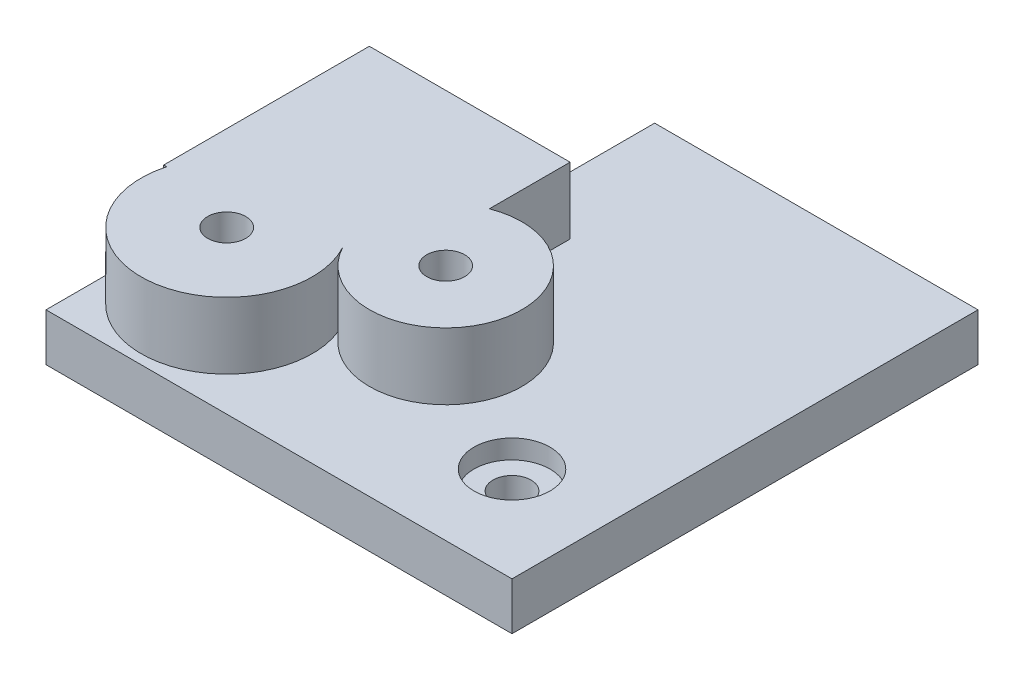
ISO-10303-21;
HEADER;
FILE_DESCRIPTION(('STEP AP214'),'2;1');
FILE_NAME('part.step','',(''),(''),'','','');
FILE_SCHEMA(('AUTOMOTIVE_DESIGN { 1 0 10303 214 1 1 1 1 }'));
ENDSEC;
DATA;
#1=APPLICATION_CONTEXT('core data for automotive mechanical design processes');
#2=APPLICATION_PROTOCOL_DEFINITION('international standard','automotive_design',2000,#1);
#3=PRODUCT_CONTEXT('',#1,'mechanical');
#4=PRODUCT('Part','Part','',(#3));
#5=PRODUCT_RELATED_PRODUCT_CATEGORY('part','',(#4));
#6=PRODUCT_DEFINITION_FORMATION('','',#4);
#7=PRODUCT_DEFINITION_CONTEXT('part definition',#1,'design');
#8=PRODUCT_DEFINITION('design','',#6,#7);
#9=PRODUCT_DEFINITION_SHAPE('','',#8);
#10=(LENGTH_UNIT() NAMED_UNIT(*) SI_UNIT(.MILLI.,.METRE.));
#11=(NAMED_UNIT(*) PLANE_ANGLE_UNIT() SI_UNIT($,.RADIAN.));
#12=(NAMED_UNIT(*) SI_UNIT($,.STERADIAN.) SOLID_ANGLE_UNIT());
#13=UNCERTAINTY_MEASURE_WITH_UNIT(LENGTH_MEASURE(1.E-05),#10,'distance_accuracy_value','');
#14=(GEOMETRIC_REPRESENTATION_CONTEXT(3) GLOBAL_UNCERTAINTY_ASSIGNED_CONTEXT((#13)) GLOBAL_UNIT_ASSIGNED_CONTEXT((#10,
#11,#12)) REPRESENTATION_CONTEXT('',''));
#15=CARTESIAN_POINT('',(0.,0.,0.));
#16=DIRECTION('',(0.,0.,1.));
#17=DIRECTION('',(1.,0.,0.));
#18=AXIS2_PLACEMENT_3D('',#15,#16,#17);
#19=CARTESIAN_POINT('',(0.,5.,-34.));
#20=DIRECTION('',(0.,0.,-1.));
#21=DIRECTION('',(-1.,0.,0.));
#22=AXIS2_PLACEMENT_3D('',#19,#20,#21);
#23=PLANE('',#22);
#24=DIRECTION('',(0.,-1.,0.));
#25=VECTOR('',#24,1.);
#26=CARTESIAN_POINT('',(0.,5.,-34.));
#27=LINE('',#26,#25);
#28=CARTESIAN_POINT('',(0.,12.,-34.));
#29=VERTEX_POINT('',#28);
#30=CARTESIAN_POINT('',(0.,0.,-34.));
#31=VERTEX_POINT('',#30);
#32=EDGE_CURVE('E138',#29,#31,#27,.T.);
#33=ORIENTED_EDGE('',*,*,#32,.F.);
#34=DIRECTION('',(-1.,0.,0.));
#35=VECTOR('',#34,1.);
#36=CARTESIAN_POINT('',(0.,12.,-34.));
#37=LINE('',#36,#35);
#38=CARTESIAN_POINT('',(21.1106318541496,12.,-34.));
#39=VERTEX_POINT('',#38);
#40=EDGE_CURVE('E124',#39,#29,#37,.T.);
#41=ORIENTED_EDGE('',*,*,#40,.F.);
#42=DIRECTION('',(0.,-1.,0.));
#43=VECTOR('',#42,1.);
#44=CARTESIAN_POINT('',(21.1106318541496,17.,-34.));
#45=LINE('',#44,#43);
#46=CARTESIAN_POINT('',(21.1106318541496,5.,-34.));
#47=VERTEX_POINT('',#46);
#48=EDGE_CURVE('E278',#39,#47,#45,.T.);
#49=ORIENTED_EDGE('',*,*,#48,.T.);
#50=DIRECTION('',(1.,0.,0.));
#51=VECTOR('',#50,1.);
#52=CARTESIAN_POINT('',(0.,5.,-34.));
#53=LINE('',#52,#51);
#54=CARTESIAN_POINT('',(15.,5.,-34.));
#55=VERTEX_POINT('',#54);
#56=EDGE_CURVE('E160',#55,#47,#53,.T.);
#57=ORIENTED_EDGE('',*,*,#56,.F.);
#58=DIRECTION('',(0.,-1.,0.));
#59=VECTOR('',#58,1.);
#60=CARTESIAN_POINT('',(15.,5.,-34.));
#61=LINE('',#60,#59);
#62=CARTESIAN_POINT('',(15.,0.,-34.));
#63=VERTEX_POINT('',#62);
#64=EDGE_CURVE('E148',#55,#63,#61,.T.);
#65=ORIENTED_EDGE('',*,*,#64,.T.);
#66=DIRECTION('',(1.,0.,0.));
#67=VECTOR('',#66,1.);
#68=CARTESIAN_POINT('',(0.,0.,-34.));
#69=LINE('',#68,#67);
#70=EDGE_CURVE('E145',#31,#63,#69,.T.);
#71=ORIENTED_EDGE('',*,*,#70,.F.);
#72=EDGE_LOOP('',(#33,#41,#49,#57,#65,#71));
#73=FACE_BOUND('',#72,.T.);
#74=ADVANCED_FACE('F38',(#73),#23,.T.);
#75=CARTESIAN_POINT('',(0.,5.,0.));
#76=DIRECTION('',(-1.,0.,0.));
#77=DIRECTION('',(0.,0.,1.));
#78=AXIS2_PLACEMENT_3D('',#75,#76,#77);
#79=PLANE('',#78);
#80=DIRECTION('',(0.,-1.,0.));
#81=VECTOR('',#80,1.);
#82=CARTESIAN_POINT('',(0.,17.,-12.3735275535495));
#83=LINE('',#82,#81);
#84=CARTESIAN_POINT('',(0.,12.,-12.3735275535495));
#85=VERTEX_POINT('',#84);
#86=CARTESIAN_POINT('',(0.,5.,-12.3735275535495));
#87=VERTEX_POINT('',#86);
#88=EDGE_CURVE('E141',#85,#87,#83,.T.);
#89=ORIENTED_EDGE('',*,*,#88,.F.);
#90=DIRECTION('',(0.,0.,1.));
#91=VECTOR('',#90,1.);
#92=CARTESIAN_POINT('',(0.,12.,-34.));
#93=LINE('',#92,#91);
#94=EDGE_CURVE('E53',#29,#85,#93,.T.);
#95=ORIENTED_EDGE('',*,*,#94,.F.);
#96=ORIENTED_EDGE('',*,*,#32,.T.);
#97=DIRECTION('',(0.,0.,-1.));
#98=VECTOR('',#97,1.);
#99=CARTESIAN_POINT('',(0.,0.,0.));
#100=LINE('',#99,#98);
#101=CARTESIAN_POINT('',(0.,0.,0.));
#102=VERTEX_POINT('',#101);
#103=EDGE_CURVE('E223',#102,#31,#100,.T.);
#104=ORIENTED_EDGE('',*,*,#103,.F.);
#105=DIRECTION('',(0.,-1.,0.));
#106=VECTOR('',#105,1.);
#107=CARTESIAN_POINT('',(0.,5.,0.));
#108=LINE('',#107,#106);
#109=CARTESIAN_POINT('',(0.,5.,0.));
#110=VERTEX_POINT('',#109);
#111=EDGE_CURVE('E149',#110,#102,#108,.T.);
#112=ORIENTED_EDGE('',*,*,#111,.F.);
#113=DIRECTION('',(0.,0.,-1.));
#114=VECTOR('',#113,1.);
#115=CARTESIAN_POINT('',(0.,5.,0.));
#116=LINE('',#115,#114);
#117=CARTESIAN_POINT('',(0.,5.,-10.));
#118=VERTEX_POINT('',#117);
#119=EDGE_CURVE('E194',#110,#118,#116,.T.);
#120=ORIENTED_EDGE('',*,*,#119,.T.);
#121=EDGE_CURVE('E193',#118,#87,#116,.T.);
#122=ORIENTED_EDGE('',*,*,#121,.T.);
#123=EDGE_LOOP('',(#89,#95,#96,#104,#112,#120,#122));
#124=FACE_BOUND('',#123,.T.);
#125=ADVANCED_FACE('F136',(#124),#79,.T.);
#126=CARTESIAN_POINT('',(9.,5.,-10.));
#127=DIRECTION('',(0.,-1.,0.));
#128=DIRECTION('',(0.,0.,-1.));
#129=AXIS2_PLACEMENT_3D('',#126,#127,#128);
#130=CYLINDRICAL_SURFACE('',#129,2.);
#131=CARTESIAN_POINT('',(9.,0.,-10.));
#132=DIRECTION('',(0.,1.,0.));
#133=DIRECTION('',(0.,0.,1.));
#134=AXIS2_PLACEMENT_3D('',#131,#132,#133);
#135=CIRCLE('',#134,2.);
#136=CARTESIAN_POINT('',(9.,0.,-8.));
#137=VERTEX_POINT('',#136);
#138=EDGE_CURVE('E171',#137,#137,#135,.T.);
#139=ORIENTED_EDGE('',*,*,#138,.F.);
#140=EDGE_LOOP('',(#139));
#141=FACE_BOUND('',#140,.T.);
#142=CARTESIAN_POINT('',(9.,12.,-10.));
#143=DIRECTION('',(0.,1.,0.));
#144=DIRECTION('',(0.,0.,1.));
#145=AXIS2_PLACEMENT_3D('',#142,#143,#144);
#146=CIRCLE('',#145,2.);
#147=CARTESIAN_POINT('',(9.,12.,-8.));
#148=VERTEX_POINT('',#147);
#149=EDGE_CURVE('E336',#148,#148,#146,.T.);
#150=ORIENTED_EDGE('',*,*,#149,.T.);
#151=EDGE_LOOP('',(#150));
#152=FACE_BOUND('',#151,.T.);
#153=ADVANCED_FACE('F312',(#141,#152),#130,.F.);
#154=CARTESIAN_POINT('',(24.,5.,-18.03));
#155=DIRECTION('',(0.,-1.,0.));
#156=DIRECTION('',(0.,0.,-1.));
#157=AXIS2_PLACEMENT_3D('',#154,#155,#156);
#158=CYLINDRICAL_SURFACE('',#157,2.);
#159=CARTESIAN_POINT('',(24.,0.,-18.03));
#160=DIRECTION('',(0.,1.,0.));
#161=DIRECTION('',(0.,0.,1.));
#162=AXIS2_PLACEMENT_3D('',#159,#160,#161);
#163=CIRCLE('',#162,2.);
#164=CARTESIAN_POINT('',(24.,0.,-16.03));
#165=VERTEX_POINT('',#164);
#166=EDGE_CURVE('E164',#165,#165,#163,.T.);
#167=ORIENTED_EDGE('',*,*,#166,.F.);
#168=EDGE_LOOP('',(#167));
#169=FACE_BOUND('',#168,.T.);
#170=CARTESIAN_POINT('',(24.,12.,-18.03));
#171=DIRECTION('',(0.,1.,0.));
#172=DIRECTION('',(0.,0.,1.));
#173=AXIS2_PLACEMENT_3D('',#170,#171,#172);
#174=CIRCLE('',#173,2.);
#175=CARTESIAN_POINT('',(24.,12.,-16.03));
#176=VERTEX_POINT('',#175);
#177=EDGE_CURVE('E339',#176,#176,#174,.T.);
#178=ORIENTED_EDGE('',*,*,#177,.T.);
#179=EDGE_LOOP('',(#178));
#180=FACE_BOUND('',#179,.T.);
#181=ADVANCED_FACE('F40',(#169,#180),#158,.F.);
#182=CARTESIAN_POINT('',(9.,17.,-10.));
#183=DIRECTION('',(0.,-1.,0.));
#184=DIRECTION('',(0.,0.,-1.));
#185=AXIS2_PLACEMENT_3D('',#182,#183,#184);
#186=CYLINDRICAL_SURFACE('',#185,9.);
#187=CARTESIAN_POINT('',(9.,12.,-10.));
#188=DIRECTION('',(0.,1.,0.));
#189=DIRECTION('',(0.,0.,1.));
#190=AXIS2_PLACEMENT_3D('',#187,#188,#189);
#191=CIRCLE('',#190,9.);
#192=CARTESIAN_POINT('',(0.318619524952183,12.,-12.3735275535495));
#193=VERTEX_POINT('',#192);
#194=CARTESIAN_POINT('',(16.9345775911375,12.,-14.2476438704556));
#195=VERTEX_POINT('',#194);
#196=EDGE_CURVE('E132',#193,#195,#191,.T.);
#197=ORIENTED_EDGE('',*,*,#196,.F.);
#198=DIRECTION('',(0.,-1.,0.));
#199=VECTOR('',#198,1.);
#200=CARTESIAN_POINT('',(0.318619524952183,17.,-12.3735275535495));
#201=LINE('',#200,#199);
#202=CARTESIAN_POINT('',(0.318619524952183,5.,-12.3735275535495));
#203=VERTEX_POINT('',#202);
#204=EDGE_CURVE('E61',#193,#203,#201,.T.);
#205=ORIENTED_EDGE('',*,*,#204,.T.);
#206=CARTESIAN_POINT('',(9.,5.,-10.));
#207=DIRECTION('',(0.,1.,0.));
#208=DIRECTION('',(0.,0.,1.));
#209=AXIS2_PLACEMENT_3D('',#206,#207,#208);
#210=CIRCLE('',#209,9.);
#211=EDGE_CURVE('E259',#203,#118,#210,.T.);
#212=ORIENTED_EDGE('',*,*,#211,.T.);
#213=CARTESIAN_POINT('',(16.9345775911375,5.,-14.2476438704556));
#214=VERTEX_POINT('',#213);
#215=EDGE_CURVE('E47',#118,#214,#210,.T.);
#216=ORIENTED_EDGE('',*,*,#215,.T.);
#217=DIRECTION('',(0.,-1.,0.));
#218=VECTOR('',#217,1.);
#219=CARTESIAN_POINT('',(16.9345775911375,17.,-14.2476438704556));
#220=LINE('',#219,#218);
#221=EDGE_CURVE('E180',#195,#214,#220,.T.);
#222=ORIENTED_EDGE('',*,*,#221,.F.);
#223=EDGE_LOOP('',(#197,#205,#212,#216,#222));
#224=FACE_BOUND('',#223,.T.);
#225=ADVANCED_FACE('F290',(#224),#186,.T.);
#226=CARTESIAN_POINT('',(24.,17.,-18.03));
#227=DIRECTION('',(0.,-1.,0.));
#228=DIRECTION('',(0.,0.,-1.));
#229=AXIS2_PLACEMENT_3D('',#226,#227,#228);
#230=CYLINDRICAL_SURFACE('',#229,8.01413823853562);
#231=CARTESIAN_POINT('',(24.,12.,-18.03));
#232=DIRECTION('',(0.,1.,0.));
#233=DIRECTION('',(0.,0.,1.));
#234=AXIS2_PLACEMENT_3D('',#231,#232,#233);
#235=CIRCLE('',#234,8.01413823853562);
#236=CARTESIAN_POINT('',(21.1106318541496,12.,-25.5051564146915));
#237=VERTEX_POINT('',#236);
#238=EDGE_CURVE('E289',#195,#237,#235,.T.);
#239=ORIENTED_EDGE('',*,*,#238,.F.);
#240=ORIENTED_EDGE('',*,*,#221,.T.);
#241=CARTESIAN_POINT('',(24.,5.,-18.03));
#242=DIRECTION('',(0.,1.,0.));
#243=DIRECTION('',(0.,0.,1.));
#244=AXIS2_PLACEMENT_3D('',#241,#242,#243);
#245=CIRCLE('',#244,8.01413823853562);
#246=CARTESIAN_POINT('',(21.1106318541496,5.,-25.5051564146915));
#247=VERTEX_POINT('',#246);
#248=EDGE_CURVE('E255',#214,#247,#245,.T.);
#249=ORIENTED_EDGE('',*,*,#248,.T.);
#250=DIRECTION('',(0.,-1.,0.));
#251=VECTOR('',#250,1.);
#252=CARTESIAN_POINT('',(21.1106318541496,17.,-25.5051564146915));
#253=LINE('',#252,#251);
#254=EDGE_CURVE('E280',#237,#247,#253,.T.);
#255=ORIENTED_EDGE('',*,*,#254,.F.);
#256=EDGE_LOOP('',(#239,#240,#249,#255));
#257=FACE_BOUND('',#256,.T.);
#258=ADVANCED_FACE('F288',(#257),#230,.T.);
#259=CARTESIAN_POINT('',(21.1106318541496,17.,0.));
#260=DIRECTION('',(1.,0.,0.));
#261=DIRECTION('',(0.,0.,-1.));
#262=AXIS2_PLACEMENT_3D('',#259,#260,#261);
#263=PLANE('',#262);
#264=ORIENTED_EDGE('',*,*,#48,.F.);
#265=DIRECTION('',(0.,0.,1.));
#266=VECTOR('',#265,1.);
#267=CARTESIAN_POINT('',(21.1106318541496,12.,0.));
#268=LINE('',#267,#266);
#269=EDGE_CURVE('E127',#39,#237,#268,.T.);
#270=ORIENTED_EDGE('',*,*,#269,.T.);
#271=ORIENTED_EDGE('',*,*,#254,.T.);
#272=DIRECTION('',(0.,0.,1.));
#273=VECTOR('',#272,1.);
#274=CARTESIAN_POINT('',(21.1106318541496,5.,0.));
#275=LINE('',#274,#273);
#276=EDGE_CURVE('E268',#47,#247,#275,.T.);
#277=ORIENTED_EDGE('',*,*,#276,.F.);
#278=EDGE_LOOP('',(#264,#270,#271,#277));
#279=FACE_BOUND('',#278,.T.);
#280=ADVANCED_FACE('F295',(#279),#263,.T.);
#281=CARTESIAN_POINT('',(0.,17.,-12.3735275535495));
#282=DIRECTION('',(0.,0.,-1.));
#283=DIRECTION('',(-1.,0.,0.));
#284=AXIS2_PLACEMENT_3D('',#281,#282,#283);
#285=PLANE('',#284);
#286=DIRECTION('',(1.,0.,0.));
#287=VECTOR('',#286,1.);
#288=CARTESIAN_POINT('',(0.,12.,-12.3735275535495));
#289=LINE('',#288,#287);
#290=EDGE_CURVE('E11',#85,#193,#289,.T.);
#291=ORIENTED_EDGE('',*,*,#290,.F.);
#292=ORIENTED_EDGE('',*,*,#88,.T.);
#293=DIRECTION('',(1.,0.,0.));
#294=VECTOR('',#293,1.);
#295=CARTESIAN_POINT('',(0.,5.,-12.3735275535495));
#296=LINE('',#295,#294);
#297=EDGE_CURVE('E264',#87,#203,#296,.T.);
#298=ORIENTED_EDGE('',*,*,#297,.T.);
#299=ORIENTED_EDGE('',*,*,#204,.F.);
#300=EDGE_LOOP('',(#291,#292,#298,#299));
#301=FACE_BOUND('',#300,.T.);
#302=ADVANCED_FACE('F293',(#301),#285,.F.);
#303=CARTESIAN_POINT('',(0.,5.,0.));
#304=DIRECTION('',(0.,1.,0.));
#305=DIRECTION('',(0.,0.,1.));
#306=AXIS2_PLACEMENT_3D('',#303,#304,#305);
#307=PLANE('',#306);
#308=ORIENTED_EDGE('',*,*,#297,.F.);
#309=ORIENTED_EDGE('',*,*,#121,.F.);
#310=ORIENTED_EDGE('',*,*,#211,.F.);
#311=EDGE_LOOP('',(#308,#309,#310));
#312=FACE_BOUND('',#311,.T.);
#313=ADVANCED_FACE('F262',(#312),#307,.T.);
#314=CARTESIAN_POINT('',(39.,5.,-10.));
#315=DIRECTION('',(0.,-1.,0.));
#316=DIRECTION('',(0.,0.,-1.));
#317=AXIS2_PLACEMENT_3D('',#314,#315,#316);
#318=CYLINDRICAL_SURFACE('',#317,2.);
#319=CARTESIAN_POINT('',(39.,0.,-10.));
#320=DIRECTION('',(0.,1.,0.));
#321=DIRECTION('',(0.,0.,1.));
#322=AXIS2_PLACEMENT_3D('',#319,#320,#321);
#323=CIRCLE('',#322,2.);
#324=CARTESIAN_POINT('',(39.,0.,-8.));
#325=VERTEX_POINT('',#324);
#326=EDGE_CURVE('E209',#325,#325,#323,.T.);
#327=ORIENTED_EDGE('',*,*,#326,.F.);
#328=EDGE_LOOP('',(#327));
#329=FACE_BOUND('',#328,.T.);
#330=CARTESIAN_POINT('',(39.,3.,-10.));
#331=DIRECTION('',(0.,1.,0.));
#332=DIRECTION('',(0.,0.,1.));
#333=AXIS2_PLACEMENT_3D('',#330,#331,#332);
#334=CIRCLE('',#333,2.);
#335=CARTESIAN_POINT('',(39.,3.,-8.));
#336=VERTEX_POINT('',#335);
#337=EDGE_CURVE('E161',#336,#336,#334,.T.);
#338=ORIENTED_EDGE('',*,*,#337,.T.);
#339=EDGE_LOOP('',(#338));
#340=FACE_BOUND('',#339,.T.);
#341=ADVANCED_FACE('F302',(#329,#340),#318,.F.);
#342=CARTESIAN_POINT('',(0.,5.,-49.));
#343=DIRECTION('',(0.,0.,-1.));
#344=DIRECTION('',(-1.,0.,0.));
#345=AXIS2_PLACEMENT_3D('',#342,#343,#344);
#346=PLANE('',#345);
#347=DIRECTION('',(1.,0.,0.));
#348=VECTOR('',#347,1.);
#349=CARTESIAN_POINT('',(0.,0.,-49.));
#350=LINE('',#349,#348);
#351=CARTESIAN_POINT('',(15.,0.,-49.));
#352=VERTEX_POINT('',#351);
#353=CARTESIAN_POINT('',(49.,0.,-49.));
#354=VERTEX_POINT('',#353);
#355=EDGE_CURVE('E213',#352,#354,#350,.T.);
#356=ORIENTED_EDGE('',*,*,#355,.F.);
#357=DIRECTION('',(0.,-1.,0.));
#358=VECTOR('',#357,1.);
#359=CARTESIAN_POINT('',(15.,5.,-49.));
#360=LINE('',#359,#358);
#361=CARTESIAN_POINT('',(15.,5.,-49.));
#362=VERTEX_POINT('',#361);
#363=EDGE_CURVE('E153',#362,#352,#360,.T.);
#364=ORIENTED_EDGE('',*,*,#363,.F.);
#365=DIRECTION('',(1.,0.,0.));
#366=VECTOR('',#365,1.);
#367=CARTESIAN_POINT('',(0.,5.,-49.));
#368=LINE('',#367,#366);
#369=CARTESIAN_POINT('',(49.,5.,-49.));
#370=VERTEX_POINT('',#369);
#371=EDGE_CURVE('E185',#362,#370,#368,.T.);
#372=ORIENTED_EDGE('',*,*,#371,.T.);
#373=DIRECTION('',(0.,-1.,0.));
#374=VECTOR('',#373,1.);
#375=CARTESIAN_POINT('',(49.,5.,-49.));
#376=LINE('',#375,#374);
#377=EDGE_CURVE('E204',#370,#354,#376,.T.);
#378=ORIENTED_EDGE('',*,*,#377,.T.);
#379=EDGE_LOOP('',(#356,#364,#372,#378));
#380=FACE_BOUND('',#379,.T.);
#381=ADVANCED_FACE('F319',(#380),#346,.T.);
#382=CARTESIAN_POINT('',(15.,5.,0.));
#383=DIRECTION('',(1.,0.,0.));
#384=DIRECTION('',(0.,0.,-1.));
#385=AXIS2_PLACEMENT_3D('',#382,#383,#384);
#386=PLANE('',#385);
#387=DIRECTION('',(0.,0.,1.));
#388=VECTOR('',#387,1.);
#389=CARTESIAN_POINT('',(15.,0.,0.));
#390=LINE('',#389,#388);
#391=EDGE_CURVE('E217',#352,#63,#390,.T.);
#392=ORIENTED_EDGE('',*,*,#391,.T.);
#393=ORIENTED_EDGE('',*,*,#64,.F.);
#394=DIRECTION('',(0.,0.,1.));
#395=VECTOR('',#394,1.);
#396=CARTESIAN_POINT('',(15.,5.,0.));
#397=LINE('',#396,#395);
#398=EDGE_CURVE('E189',#362,#55,#397,.T.);
#399=ORIENTED_EDGE('',*,*,#398,.F.);
#400=ORIENTED_EDGE('',*,*,#363,.T.);
#401=EDGE_LOOP('',(#392,#393,#399,#400));
#402=FACE_BOUND('',#401,.T.);
#403=ADVANCED_FACE('F316',(#402),#386,.F.);
#404=CARTESIAN_POINT('',(0.,5.,0.));
#405=DIRECTION('',(0.,0.,-1.));
#406=DIRECTION('',(-1.,0.,0.));
#407=AXIS2_PLACEMENT_3D('',#404,#405,#406);
#408=PLANE('',#407);
#409=DIRECTION('',(1.,0.,0.));
#410=VECTOR('',#409,1.);
#411=CARTESIAN_POINT('',(0.,0.,0.));
#412=LINE('',#411,#410);
#413=CARTESIAN_POINT('',(49.,0.,0.));
#414=VERTEX_POINT('',#413);
#415=EDGE_CURVE('E226',#102,#414,#412,.T.);
#416=ORIENTED_EDGE('',*,*,#415,.T.);
#417=DIRECTION('',(0.,-1.,0.));
#418=VECTOR('',#417,1.);
#419=CARTESIAN_POINT('',(49.,5.,0.));
#420=LINE('',#419,#418);
#421=CARTESIAN_POINT('',(49.,5.,0.));
#422=VERTEX_POINT('',#421);
#423=EDGE_CURVE('E155',#422,#414,#420,.T.);
#424=ORIENTED_EDGE('',*,*,#423,.F.);
#425=DIRECTION('',(1.,0.,0.));
#426=VECTOR('',#425,1.);
#427=CARTESIAN_POINT('',(0.,5.,0.));
#428=LINE('',#427,#426);
#429=EDGE_CURVE('E198',#110,#422,#428,.T.);
#430=ORIENTED_EDGE('',*,*,#429,.F.);
#431=ORIENTED_EDGE('',*,*,#111,.T.);
#432=EDGE_LOOP('',(#416,#424,#430,#431));
#433=FACE_BOUND('',#432,.T.);
#434=ADVANCED_FACE('F243',(#433),#408,.F.);
#435=CARTESIAN_POINT('',(49.,5.,0.));
#436=DIRECTION('',(-1.,0.,0.));
#437=DIRECTION('',(0.,0.,1.));
#438=AXIS2_PLACEMENT_3D('',#435,#436,#437);
#439=PLANE('',#438);
#440=DIRECTION('',(0.,0.,-1.));
#441=VECTOR('',#440,1.);
#442=CARTESIAN_POINT('',(49.,0.,0.));
#443=LINE('',#442,#441);
#444=EDGE_CURVE('E190',#414,#354,#443,.T.);
#445=ORIENTED_EDGE('',*,*,#444,.T.);
#446=ORIENTED_EDGE('',*,*,#377,.F.);
#447=DIRECTION('',(0.,0.,-1.));
#448=VECTOR('',#447,1.);
#449=CARTESIAN_POINT('',(49.,5.,0.));
#450=LINE('',#449,#448);
#451=EDGE_CURVE('E202',#422,#370,#450,.T.);
#452=ORIENTED_EDGE('',*,*,#451,.F.);
#453=ORIENTED_EDGE('',*,*,#423,.T.);
#454=EDGE_LOOP('',(#445,#446,#452,#453));
#455=FACE_BOUND('',#454,.T.);
#456=ADVANCED_FACE('F238',(#455),#439,.F.);
#457=ORIENTED_EDGE('',*,*,#215,.F.);
#458=ORIENTED_EDGE('',*,*,#119,.F.);
#459=ORIENTED_EDGE('',*,*,#429,.T.);
#460=ORIENTED_EDGE('',*,*,#451,.T.);
#461=ORIENTED_EDGE('',*,*,#371,.F.);
#462=ORIENTED_EDGE('',*,*,#398,.T.);
#463=ORIENTED_EDGE('',*,*,#56,.T.);
#464=ORIENTED_EDGE('',*,*,#276,.T.);
#465=ORIENTED_EDGE('',*,*,#248,.F.);
#466=EDGE_LOOP('',(#457,#458,#459,#460,#461,#462,#463,#464,#465));
#467=FACE_BOUND('',#466,.T.);
#468=CARTESIAN_POINT('',(39.,5.,-10.));
#469=DIRECTION('',(0.,1.,0.));
#470=DIRECTION('',(0.,0.,1.));
#471=AXIS2_PLACEMENT_3D('',#468,#469,#470);
#472=CIRCLE('',#471,4.);
#473=CARTESIAN_POINT('',(39.,5.,-6.));
#474=VERTEX_POINT('',#473);
#475=EDGE_CURVE('E174',#474,#474,#472,.T.);
#476=ORIENTED_EDGE('',*,*,#475,.F.);
#477=EDGE_LOOP('',(#476));
#478=FACE_BOUND('',#477,.T.);
#479=ADVANCED_FACE('F248',(#467,#478),#307,.T.);
#480=CARTESIAN_POINT('',(0.,0.,0.));
#481=DIRECTION('',(0.,1.,0.));
#482=DIRECTION('',(0.,0.,1.));
#483=AXIS2_PLACEMENT_3D('',#480,#481,#482);
#484=PLANE('',#483);
#485=ORIENTED_EDGE('',*,*,#166,.T.);
#486=EDGE_LOOP('',(#485));
#487=FACE_BOUND('',#486,.T.);
#488=ORIENTED_EDGE('',*,*,#138,.T.);
#489=EDGE_LOOP('',(#488));
#490=FACE_BOUND('',#489,.T.);
#491=ORIENTED_EDGE('',*,*,#326,.T.);
#492=EDGE_LOOP('',(#491));
#493=FACE_BOUND('',#492,.T.);
#494=ORIENTED_EDGE('',*,*,#355,.T.);
#495=ORIENTED_EDGE('',*,*,#444,.F.);
#496=ORIENTED_EDGE('',*,*,#415,.F.);
#497=ORIENTED_EDGE('',*,*,#103,.T.);
#498=ORIENTED_EDGE('',*,*,#70,.T.);
#499=ORIENTED_EDGE('',*,*,#391,.F.);
#500=EDGE_LOOP('',(#494,#495,#496,#497,#498,#499));
#501=FACE_BOUND('',#500,.T.);
#502=ADVANCED_FACE('F245',(#487,#490,#493,#501),#484,.F.);
#503=CARTESIAN_POINT('',(39.,3.,-10.));
#504=DIRECTION('',(0.,1.,0.));
#505=DIRECTION('',(0.,0.,1.));
#506=AXIS2_PLACEMENT_3D('',#503,#504,#505);
#507=CYLINDRICAL_SURFACE('',#506,4.);
#508=CARTESIAN_POINT('',(39.,3.,-10.));
#509=DIRECTION('',(0.,1.,0.));
#510=DIRECTION('',(0.,0.,1.));
#511=AXIS2_PLACEMENT_3D('',#508,#509,#510);
#512=CIRCLE('',#511,4.);
#513=CARTESIAN_POINT('',(39.,3.,-6.));
#514=VERTEX_POINT('',#513);
#515=EDGE_CURVE('E165',#514,#514,#512,.T.);
#516=ORIENTED_EDGE('',*,*,#515,.F.);
#517=EDGE_LOOP('',(#516));
#518=FACE_BOUND('',#517,.T.);
#519=ORIENTED_EDGE('',*,*,#475,.T.);
#520=EDGE_LOOP('',(#519));
#521=FACE_BOUND('',#520,.T.);
#522=ADVANCED_FACE('F367',(#518,#521),#507,.F.);
#523=CARTESIAN_POINT('',(39.,3.,-10.));
#524=DIRECTION('',(0.,1.,0.));
#525=DIRECTION('',(0.,0.,1.));
#526=AXIS2_PLACEMENT_3D('',#523,#524,#525);
#527=PLANE('',#526);
#528=ORIENTED_EDGE('',*,*,#337,.F.);
#529=EDGE_LOOP('',(#528));
#530=FACE_BOUND('',#529,.T.);
#531=ORIENTED_EDGE('',*,*,#515,.T.);
#532=EDGE_LOOP('',(#531));
#533=FACE_BOUND('',#532,.T.);
#534=ADVANCED_FACE('F363',(#530,#533),#527,.T.);
#535=CARTESIAN_POINT('',(0.,12.,0.));
#536=DIRECTION('',(0.,1.,0.));
#537=DIRECTION('',(0.,0.,1.));
#538=AXIS2_PLACEMENT_3D('',#535,#536,#537);
#539=PLANE('',#538);
#540=ORIENTED_EDGE('',*,*,#149,.F.);
#541=EDGE_LOOP('',(#540));
#542=FACE_BOUND('',#541,.T.);
#543=ORIENTED_EDGE('',*,*,#177,.F.);
#544=EDGE_LOOP('',(#543));
#545=FACE_BOUND('',#544,.T.);
#546=ORIENTED_EDGE('',*,*,#40,.T.);
#547=ORIENTED_EDGE('',*,*,#94,.T.);
#548=ORIENTED_EDGE('',*,*,#290,.T.);
#549=ORIENTED_EDGE('',*,*,#196,.T.);
#550=ORIENTED_EDGE('',*,*,#238,.T.);
#551=ORIENTED_EDGE('',*,*,#269,.F.);
#552=EDGE_LOOP('',(#546,#547,#548,#549,#550,#551));
#553=FACE_BOUND('',#552,.T.);
#554=ADVANCED_FACE('F125',(#542,#545,#553),#539,.T.);
#555=CLOSED_SHELL('',(#74,#125,#153,#181,#225,#258,#280,#302,#313,#341,#381,#403,#434,#456,#479,
#502,#522,#534,#554));
#556=MANIFOLD_SOLID_BREP('B2',#555);
#557=ADVANCED_BREP_SHAPE_REPRESENTATION('',(#18,#556),#14);
#558=SHAPE_DEFINITION_REPRESENTATION(#9,#557);
ENDSEC;
END-ISO-10303-21;
